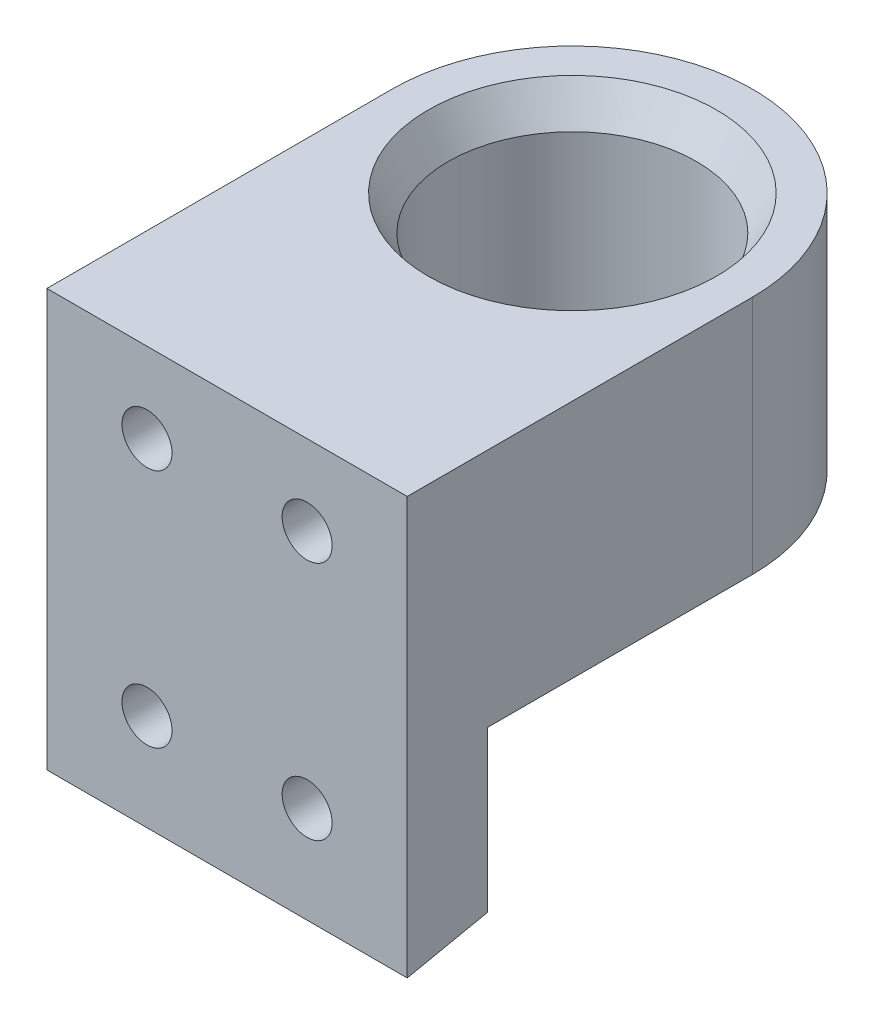
ISO-10303-21;
HEADER;
FILE_DESCRIPTION(('STEP AP214'),'2;1');
FILE_NAME('part.step','',(''),(''),'','','');
FILE_SCHEMA(('AUTOMOTIVE_DESIGN { 1 0 10303 214 1 1 1 1 }'));
ENDSEC;
DATA;
#1=APPLICATION_CONTEXT('core data for automotive mechanical design processes');
#2=APPLICATION_PROTOCOL_DEFINITION('international standard','automotive_design',2000,#1);
#3=PRODUCT_CONTEXT('',#1,'mechanical');
#4=PRODUCT('Part','Part','',(#3));
#5=PRODUCT_RELATED_PRODUCT_CATEGORY('part','',(#4));
#6=PRODUCT_DEFINITION_FORMATION('','',#4);
#7=PRODUCT_DEFINITION_CONTEXT('part definition',#1,'design');
#8=PRODUCT_DEFINITION('design','',#6,#7);
#9=PRODUCT_DEFINITION_SHAPE('','',#8);
#10=(LENGTH_UNIT() NAMED_UNIT(*) SI_UNIT(.MILLI.,.METRE.));
#11=(NAMED_UNIT(*) PLANE_ANGLE_UNIT() SI_UNIT($,.RADIAN.));
#12=(NAMED_UNIT(*) SI_UNIT($,.STERADIAN.) SOLID_ANGLE_UNIT());
#13=UNCERTAINTY_MEASURE_WITH_UNIT(LENGTH_MEASURE(1.E-05),#10,'distance_accuracy_value','');
#14=(GEOMETRIC_REPRESENTATION_CONTEXT(3) GLOBAL_UNCERTAINTY_ASSIGNED_CONTEXT((#13)) GLOBAL_UNIT_ASSIGNED_CONTEXT((#10,
#11,#12)) REPRESENTATION_CONTEXT('',''));
#15=CARTESIAN_POINT('',(0.,0.,0.));
#16=DIRECTION('',(0.,0.,1.));
#17=DIRECTION('',(1.,0.,0.));
#18=AXIS2_PLACEMENT_3D('',#15,#16,#17);
#19=CARTESIAN_POINT('',(0.,0.,0.));
#20=DIRECTION('',(0.,0.,1.));
#21=DIRECTION('',(1.,0.,0.));
#22=AXIS2_PLACEMENT_3D('',#19,#20,#21);
#23=PLANE('',#22);
#24=CARTESIAN_POINT('',(-3.99999999999996,45.949999999998,0.));
#25=DIRECTION('',(0.,0.,1.));
#26=DIRECTION('',(1.,0.,0.));
#27=AXIS2_PLACEMENT_3D('',#24,#25,#26);
#28=CIRCLE('',#27,1.25);
#29=CARTESIAN_POINT('',(-2.74999999999996,45.949999999998,0.));
#30=VERTEX_POINT('',#29);
#31=EDGE_CURVE('E480',#30,#30,#28,.F.);
#32=ORIENTED_EDGE('',*,*,#31,.T.);
#33=EDGE_LOOP('',(#32));
#34=FACE_BOUND('',#33,.T.);
#35=CARTESIAN_POINT('',(4.00000000000005,33.949999999998,0.));
#36=DIRECTION('',(0.,0.,1.));
#37=DIRECTION('',(1.,0.,0.));
#38=AXIS2_PLACEMENT_3D('',#35,#36,#37);
#39=CIRCLE('',#38,1.25);
#40=CARTESIAN_POINT('',(5.25000000000005,33.949999999998,0.));
#41=VERTEX_POINT('',#40);
#42=EDGE_CURVE('E489',#41,#41,#39,.F.);
#43=ORIENTED_EDGE('',*,*,#42,.T.);
#44=EDGE_LOOP('',(#43));
#45=FACE_BOUND('',#44,.T.);
#46=CARTESIAN_POINT('',(-3.99999999999996,33.949999999998,0.));
#47=DIRECTION('',(0.,0.,1.));
#48=DIRECTION('',(1.,0.,0.));
#49=AXIS2_PLACEMENT_3D('',#46,#47,#48);
#50=CIRCLE('',#49,1.25);
#51=CARTESIAN_POINT('',(-2.74999999999996,33.949999999998,0.));
#52=VERTEX_POINT('',#51);
#53=EDGE_CURVE('E492',#52,#52,#50,.F.);
#54=ORIENTED_EDGE('',*,*,#53,.T.);
#55=EDGE_LOOP('',(#54));
#56=FACE_BOUND('',#55,.T.);
#57=CARTESIAN_POINT('',(4.00000000000005,45.949999999998,0.));
#58=DIRECTION('',(0.,0.,1.));
#59=DIRECTION('',(1.,0.,0.));
#60=AXIS2_PLACEMENT_3D('',#57,#58,#59);
#61=CIRCLE('',#60,1.25);
#62=CARTESIAN_POINT('',(5.25000000000005,45.949999999998,0.));
#63=VERTEX_POINT('',#62);
#64=EDGE_CURVE('E484',#63,#63,#61,.F.);
#65=ORIENTED_EDGE('',*,*,#64,.T.);
#66=EDGE_LOOP('',(#65));
#67=FACE_BOUND('',#66,.T.);
#68=DIRECTION('',(1.,0.,0.));
#69=VECTOR('',#68,1.);
#70=CARTESIAN_POINT('',(-6.49999999999996,49.949999999998,0.));
#71=LINE('',#70,#69);
#72=CARTESIAN_POINT('',(-8.99999999999995,49.949999999998,0.));
#73=VERTEX_POINT('',#72);
#74=CARTESIAN_POINT('',(9.00000000000005,49.949999999998,0.));
#75=VERTEX_POINT('',#74);
#76=EDGE_CURVE('E461',#73,#75,#71,.T.);
#77=ORIENTED_EDGE('',*,*,#76,.F.);
#78=DIRECTION('',(0.,-1.,0.));
#79=VECTOR('',#78,1.);
#80=CARTESIAN_POINT('',(-8.99999999999995,37.949999999998,0.));
#81=LINE('',#80,#79);
#82=CARTESIAN_POINT('',(-8.99999999999996,29.1166661729509,0.));
#83=VERTEX_POINT('',#82);
#84=EDGE_CURVE('E472',#73,#83,#81,.T.);
#85=ORIENTED_EDGE('',*,*,#84,.T.);
#86=DIRECTION('',(-1.,0.,0.));
#87=VECTOR('',#86,1.);
#88=CARTESIAN_POINT('',(36.2946756253056,29.1166661729509,0.));
#89=LINE('',#88,#87);
#90=CARTESIAN_POINT('',(9.00000000000005,29.1166661729509,0.));
#91=VERTEX_POINT('',#90);
#92=EDGE_CURVE('E476',#91,#83,#89,.T.);
#93=ORIENTED_EDGE('',*,*,#92,.F.);
#94=DIRECTION('',(0.,1.,0.));
#95=VECTOR('',#94,1.);
#96=CARTESIAN_POINT('',(9.00000000000005,37.949999999998,0.));
#97=LINE('',#96,#95);
#98=EDGE_CURVE('E475',#91,#75,#97,.T.);
#99=ORIENTED_EDGE('',*,*,#98,.T.);
#100=EDGE_LOOP('',(#77,#85,#93,#99));
#101=FACE_BOUND('',#100,.T.);
#102=ADVANCED_FACE('F401',(#34,#45,#56,#67,#101),#23,.T.);
#103=CARTESIAN_POINT('',(-1.39594096278655E-13,-23.9468118973006,-17.2500071094743));
#104=DIRECTION('',(0.,1.,0.));
#105=DIRECTION('',(0.,0.,1.));
#106=AXIS2_PLACEMENT_3D('',#103,#104,#105);
#107=CYLINDRICAL_SURFACE('',#106,6.2);
#108=CARTESIAN_POINT('',(-1.39594096278655E-13,48.2179491924292,-17.2500071094743));
#109=DIRECTION('',(0.,1.,0.));
#110=DIRECTION('',(0.,0.,1.));
#111=AXIS2_PLACEMENT_3D('',#108,#109,#110);
#112=CIRCLE('',#111,6.2);
#113=CARTESIAN_POINT('',(-1.39594096278655E-13,48.2179491924292,-11.0500071094743));
#114=VERTEX_POINT('',#113);
#115=EDGE_CURVE('E505',#114,#114,#112,.T.);
#116=ORIENTED_EDGE('',*,*,#115,.T.);
#117=EDGE_LOOP('',(#116));
#118=FACE_BOUND('',#117,.T.);
#119=CARTESIAN_POINT('',(-1.39594096278655E-13,39.6820508075669,-17.2500071094743));
#120=DIRECTION('',(0.,1.,0.));
#121=DIRECTION('',(0.,0.,1.));
#122=AXIS2_PLACEMENT_3D('',#119,#120,#121);
#123=CIRCLE('',#122,6.2);
#124=CARTESIAN_POINT('',(-1.39594096278655E-13,39.6820508075669,-11.0500071094743));
#125=VERTEX_POINT('',#124);
#126=EDGE_CURVE('E502',#125,#125,#123,.F.);
#127=ORIENTED_EDGE('',*,*,#126,.T.);
#128=EDGE_LOOP('',(#127));
#129=FACE_BOUND('',#128,.T.);
#130=ADVANCED_FACE('F518',(#118,#129),#107,.F.);
#131=CARTESIAN_POINT('',(-8.99999999999995,37.949999999998,-30.000014218949));
#132=DIRECTION('',(0.,1.,0.));
#133=DIRECTION('',(0.,0.,1.));
#134=AXIS2_PLACEMENT_3D('',#131,#132,#133);
#135=PLANE('',#134);
#136=CARTESIAN_POINT('',(-1.39594096278655E-13,37.949999999998,-17.2500071094743));
#137=DIRECTION('',(0.,1.,0.));
#138=DIRECTION('',(0.,0.,1.));
#139=AXIS2_PLACEMENT_3D('',#136,#137,#138);
#140=CIRCLE('',#139,7.2);
#141=CARTESIAN_POINT('',(-1.39594096278655E-13,37.949999999998,-10.0500071094743));
#142=VERTEX_POINT('',#141);
#143=EDGE_CURVE('E13',#142,#142,#140,.T.);
#144=ORIENTED_EDGE('',*,*,#143,.T.);
#145=EDGE_LOOP('',(#144));
#146=FACE_BOUND('',#145,.T.);
#147=DIRECTION('',(0.,0.,1.));
#148=VECTOR('',#147,1.);
#149=CARTESIAN_POINT('',(9.00000000000005,37.949999999998,-30.000014218949));
#150=LINE('',#149,#148);
#151=CARTESIAN_POINT('',(9.00000000000006,37.949999999998,-17.2500071094689));
#152=VERTEX_POINT('',#151);
#153=CARTESIAN_POINT('',(9.00000000000005,37.949999999998,-4.));
#154=VERTEX_POINT('',#153);
#155=EDGE_CURVE('E536',#152,#154,#150,.T.);
#156=ORIENTED_EDGE('',*,*,#155,.T.);
#157=DIRECTION('',(-1.,0.,0.));
#158=VECTOR('',#157,1.);
#159=CARTESIAN_POINT('',(36.2946756253056,37.949999999998,-4.));
#160=LINE('',#159,#158);
#161=CARTESIAN_POINT('',(-8.99999999999996,37.949999999998,-4.));
#162=VERTEX_POINT('',#161);
#163=EDGE_CURVE('E538',#154,#162,#160,.T.);
#164=ORIENTED_EDGE('',*,*,#163,.T.);
#165=DIRECTION('',(0.,0.,1.));
#166=VECTOR('',#165,1.);
#167=CARTESIAN_POINT('',(-8.99999999999995,37.949999999998,-30.000014218949));
#168=LINE('',#167,#166);
#169=CARTESIAN_POINT('',(-8.99999999999995,37.949999999998,-17.2500071094689));
#170=VERTEX_POINT('',#169);
#171=EDGE_CURVE('E468',#170,#162,#168,.T.);
#172=ORIENTED_EDGE('',*,*,#171,.F.);
#173=CARTESIAN_POINT('',(0.,37.949999999998,-17.2500071094689));
#174=DIRECTION('',(0.,1.,0.));
#175=DIRECTION('',(0.,0.,1.));
#176=AXIS2_PLACEMENT_3D('',#173,#174,#175);
#177=CIRCLE('',#176,9.);
#178=EDGE_CURVE('E496',#170,#152,#177,.F.);
#179=ORIENTED_EDGE('',*,*,#178,.T.);
#180=EDGE_LOOP('',(#156,#164,#172,#179));
#181=FACE_BOUND('',#180,.T.);
#182=ADVANCED_FACE('F521',(#146,#181),#135,.F.);
#183=CARTESIAN_POINT('',(0.,-23.9468118973006,-17.2500071094689));
#184=DIRECTION('',(0.,1.,0.));
#185=DIRECTION('',(0.,0.,1.));
#186=AXIS2_PLACEMENT_3D('',#183,#184,#185);
#187=CYLINDRICAL_SURFACE('',#186,9.);
#188=DIRECTION('',(0.,-1.,0.));
#189=VECTOR('',#188,1.);
#190=CARTESIAN_POINT('',(-8.99999999999995,37.949999999998,-17.2500071094689));
#191=LINE('',#190,#189);
#192=CARTESIAN_POINT('',(-8.99999999999994,49.949999999998,-17.2500071094689));
#193=VERTEX_POINT('',#192);
#194=EDGE_CURVE('E542',#193,#170,#191,.T.);
#195=ORIENTED_EDGE('',*,*,#194,.F.);
#196=CARTESIAN_POINT('',(0.,49.949999999998,-17.2500071094689));
#197=DIRECTION('',(0.,-1.,0.));
#198=DIRECTION('',(0.,0.,-1.));
#199=AXIS2_PLACEMENT_3D('',#196,#197,#198);
#200=CIRCLE('',#199,9.);
#201=CARTESIAN_POINT('',(9.00000000000006,49.949999999998,-17.2500071094689));
#202=VERTEX_POINT('',#201);
#203=EDGE_CURVE('E463',#193,#202,#200,.T.);
#204=ORIENTED_EDGE('',*,*,#203,.T.);
#205=DIRECTION('',(0.,1.,0.));
#206=VECTOR('',#205,1.);
#207=CARTESIAN_POINT('',(9.00000000000006,-23.9468118973006,-17.2500071094689));
#208=LINE('',#207,#206);
#209=EDGE_CURVE('E548',#152,#202,#208,.T.);
#210=ORIENTED_EDGE('',*,*,#209,.F.);
#211=ORIENTED_EDGE('',*,*,#178,.F.);
#212=EDGE_LOOP('',(#195,#204,#210,#211));
#213=FACE_BOUND('',#212,.T.);
#214=ADVANCED_FACE('F531',(#213),#187,.T.);
#215=CARTESIAN_POINT('',(-6.49999999999996,49.949999999998,-27.6132347424758));
#216=DIRECTION('',(0.,1.,0.));
#217=DIRECTION('',(0.,0.,1.));
#218=AXIS2_PLACEMENT_3D('',#215,#216,#217);
#219=PLANE('',#218);
#220=CARTESIAN_POINT('',(-1.39594096278655E-13,49.949999999998,-17.2500071094743));
#221=DIRECTION('',(0.,1.,0.));
#222=DIRECTION('',(0.,0.,1.));
#223=AXIS2_PLACEMENT_3D('',#220,#221,#222);
#224=CIRCLE('',#223,7.19999999999999);
#225=CARTESIAN_POINT('',(-1.39594096278655E-13,49.949999999998,-10.0500071094743));
#226=VERTEX_POINT('',#225);
#227=EDGE_CURVE('E410',#226,#226,#224,.F.);
#228=ORIENTED_EDGE('',*,*,#227,.T.);
#229=EDGE_LOOP('',(#228));
#230=FACE_BOUND('',#229,.T.);
#231=DIRECTION('',(0.,0.,1.));
#232=VECTOR('',#231,1.);
#233=CARTESIAN_POINT('',(-8.99999999999995,49.949999999998,-30.000014218949));
#234=LINE('',#233,#232);
#235=EDGE_CURVE('E457',#193,#73,#234,.T.);
#236=ORIENTED_EDGE('',*,*,#235,.T.);
#237=ORIENTED_EDGE('',*,*,#76,.T.);
#238=DIRECTION('',(0.,0.,1.));
#239=VECTOR('',#238,1.);
#240=CARTESIAN_POINT('',(9.00000000000005,49.949999999998,-30.000014218949));
#241=LINE('',#240,#239);
#242=EDGE_CURVE('E467',#202,#75,#241,.T.);
#243=ORIENTED_EDGE('',*,*,#242,.F.);
#244=ORIENTED_EDGE('',*,*,#203,.F.);
#245=EDGE_LOOP('',(#236,#237,#243,#244));
#246=FACE_BOUND('',#245,.T.);
#247=ADVANCED_FACE('F459',(#230,#246),#219,.T.);
#248=CARTESIAN_POINT('',(36.2946756253056,37.949999999998,-4.));
#249=DIRECTION('',(0.,0.,-1.));
#250=DIRECTION('',(0.,1.,0.));
#251=AXIS2_PLACEMENT_3D('',#248,#249,#250);
#252=PLANE('',#251);
#253=CARTESIAN_POINT('',(-3.99999999999996,33.949999999998,-4.));
#254=DIRECTION('',(0.,0.,-1.));
#255=DIRECTION('',(0.,1.,0.));
#256=AXIS2_PLACEMENT_3D('',#253,#254,#255);
#257=CIRCLE('',#256,1.25);
#258=CARTESIAN_POINT('',(-3.99999999999996,35.199999999998,-4.));
#259=VERTEX_POINT('',#258);
#260=EDGE_CURVE('E558',#259,#259,#257,.T.);
#261=ORIENTED_EDGE('',*,*,#260,.F.);
#262=EDGE_LOOP('',(#261));
#263=FACE_BOUND('',#262,.T.);
#264=CARTESIAN_POINT('',(4.00000000000005,33.949999999998,-4.));
#265=DIRECTION('',(0.,0.,-1.));
#266=DIRECTION('',(0.,1.,0.));
#267=AXIS2_PLACEMENT_3D('',#264,#265,#266);
#268=CIRCLE('',#267,1.25);
#269=CARTESIAN_POINT('',(4.00000000000005,35.199999999998,-4.));
#270=VERTEX_POINT('',#269);
#271=EDGE_CURVE('E506',#270,#270,#268,.T.);
#272=ORIENTED_EDGE('',*,*,#271,.F.);
#273=EDGE_LOOP('',(#272));
#274=FACE_BOUND('',#273,.T.);
#275=DIRECTION('',(0.,1.,0.));
#276=VECTOR('',#275,1.);
#277=CARTESIAN_POINT('',(9.00000000000005,37.949999999998,-4.));
#278=LINE('',#277,#276);
#279=CARTESIAN_POINT('',(9.00000000000005,29.949999999998,-4.));
#280=VERTEX_POINT('',#279);
#281=EDGE_CURVE('E499',#280,#154,#278,.T.);
#282=ORIENTED_EDGE('',*,*,#281,.F.);
#283=DIRECTION('',(-1.,0.,0.));
#284=VECTOR('',#283,1.);
#285=CARTESIAN_POINT('',(36.2946756253056,29.949999999998,-4.));
#286=LINE('',#285,#284);
#287=CARTESIAN_POINT('',(-8.99999999999996,29.949999999998,-4.));
#288=VERTEX_POINT('',#287);
#289=EDGE_CURVE('E422',#280,#288,#286,.T.);
#290=ORIENTED_EDGE('',*,*,#289,.T.);
#291=DIRECTION('',(0.,-1.,0.));
#292=VECTOR('',#291,1.);
#293=CARTESIAN_POINT('',(-8.99999999999996,37.949999999998,-4.));
#294=LINE('',#293,#292);
#295=EDGE_CURVE('E417',#162,#288,#294,.T.);
#296=ORIENTED_EDGE('',*,*,#295,.F.);
#297=ORIENTED_EDGE('',*,*,#163,.F.);
#298=EDGE_LOOP('',(#282,#290,#296,#297));
#299=FACE_BOUND('',#298,.T.);
#300=ADVANCED_FACE('F575',(#263,#274,#299),#252,.T.);
#301=CARTESIAN_POINT('',(-3.99999999999996,33.949999999998,10.));
#302=DIRECTION('',(0.,0.,-1.));
#303=DIRECTION('',(0.,1.,0.));
#304=AXIS2_PLACEMENT_3D('',#301,#302,#303);
#305=CYLINDRICAL_SURFACE('',#304,1.25);
#306=ORIENTED_EDGE('',*,*,#260,.T.);
#307=EDGE_LOOP('',(#306));
#308=FACE_BOUND('',#307,.T.);
#309=ORIENTED_EDGE('',*,*,#53,.F.);
#310=EDGE_LOOP('',(#309));
#311=FACE_BOUND('',#310,.T.);
#312=ADVANCED_FACE('F580',(#308,#311),#305,.F.);
#313=CARTESIAN_POINT('',(4.00000000000005,33.949999999998,10.));
#314=DIRECTION('',(0.,0.,-1.));
#315=DIRECTION('',(0.,1.,0.));
#316=AXIS2_PLACEMENT_3D('',#313,#314,#315);
#317=CYLINDRICAL_SURFACE('',#316,1.25);
#318=ORIENTED_EDGE('',*,*,#271,.T.);
#319=EDGE_LOOP('',(#318));
#320=FACE_BOUND('',#319,.T.);
#321=ORIENTED_EDGE('',*,*,#42,.F.);
#322=EDGE_LOOP('',(#321));
#323=FACE_BOUND('',#322,.T.);
#324=ADVANCED_FACE('F596',(#320,#323),#317,.F.);
#325=CARTESIAN_POINT('',(-8.99999999999995,37.949999999998,-30.000014218949));
#326=DIRECTION('',(1.,0.,0.));
#327=DIRECTION('',(0.,1.,0.));
#328=AXIS2_PLACEMENT_3D('',#325,#326,#327);
#329=PLANE('',#328);
#330=ORIENTED_EDGE('',*,*,#84,.F.);
#331=ORIENTED_EDGE('',*,*,#235,.F.);
#332=ORIENTED_EDGE('',*,*,#194,.T.);
#333=ORIENTED_EDGE('',*,*,#171,.T.);
#334=ORIENTED_EDGE('',*,*,#295,.T.);
#335=DIRECTION('',(0.,-0.203954369919658,0.978980395611003));
#336=VECTOR('',#335,1.);
#337=CARTESIAN_POINT('',(-8.99999999999996,29.949999999998,-4.));
#338=LINE('',#337,#336);
#339=EDGE_CURVE('E479',#288,#83,#338,.T.);
#340=ORIENTED_EDGE('',*,*,#339,.T.);
#341=EDGE_LOOP('',(#330,#331,#332,#333,#334,#340));
#342=FACE_BOUND('',#341,.T.);
#343=ADVANCED_FACE('F478',(#342),#329,.F.);
#344=CARTESIAN_POINT('',(9.00000000000005,37.949999999998,-30.000014218949));
#345=DIRECTION('',(-1.,0.,0.));
#346=DIRECTION('',(0.,0.,1.));
#347=AXIS2_PLACEMENT_3D('',#344,#345,#346);
#348=PLANE('',#347);
#349=ORIENTED_EDGE('',*,*,#98,.F.);
#350=DIRECTION('',(0.,0.203954369919658,-0.978980395611003));
#351=VECTOR('',#350,1.);
#352=CARTESIAN_POINT('',(9.00000000000005,29.949999999998,-4.));
#353=LINE('',#352,#351);
#354=EDGE_CURVE('E497',#91,#280,#353,.T.);
#355=ORIENTED_EDGE('',*,*,#354,.T.);
#356=ORIENTED_EDGE('',*,*,#281,.T.);
#357=ORIENTED_EDGE('',*,*,#155,.F.);
#358=ORIENTED_EDGE('',*,*,#209,.T.);
#359=ORIENTED_EDGE('',*,*,#242,.T.);
#360=EDGE_LOOP('',(#349,#355,#356,#357,#358,#359));
#361=FACE_BOUND('',#360,.T.);
#362=ADVANCED_FACE('F568',(#361),#348,.F.);
#363=CARTESIAN_POINT('',(36.2946756253056,29.949999999998,-4.));
#364=DIRECTION('',(0.,-0.978980395611003,-0.203954369919658));
#365=DIRECTION('',(0.,0.203954369919658,-0.978980395611003));
#366=AXIS2_PLACEMENT_3D('',#363,#364,#365);
#367=PLANE('',#366);
#368=ORIENTED_EDGE('',*,*,#354,.F.);
#369=ORIENTED_EDGE('',*,*,#92,.T.);
#370=ORIENTED_EDGE('',*,*,#339,.F.);
#371=ORIENTED_EDGE('',*,*,#289,.F.);
#372=EDGE_LOOP('',(#368,#369,#370,#371));
#373=FACE_BOUND('',#372,.T.);
#374=ADVANCED_FACE('F567',(#373),#367,.T.);
#375=CARTESIAN_POINT('',(4.00000000000005,45.949999999998,-9.99999999999999));
#376=DIRECTION('',(0.,0.,1.));
#377=DIRECTION('',(1.,0.,0.));
#378=AXIS2_PLACEMENT_3D('',#375,#376,#377);
#379=PLANE('',#378);
#380=CARTESIAN_POINT('',(4.00000000000005,45.949999999998,-9.99999999999999));
#381=DIRECTION('',(0.,0.,1.));
#382=DIRECTION('',(1.,0.,0.));
#383=AXIS2_PLACEMENT_3D('',#380,#381,#382);
#384=CIRCLE('',#383,1.25);
#385=CARTESIAN_POINT('',(5.25000000000005,45.949999999998,-9.99999999999999));
#386=VERTEX_POINT('',#385);
#387=EDGE_CURVE('E501',#386,#386,#384,.T.);
#388=ORIENTED_EDGE('',*,*,#387,.T.);
#389=EDGE_LOOP('',(#388));
#390=FACE_BOUND('',#389,.T.);
#391=ADVANCED_FACE('F587',(#390),#379,.T.);
#392=CARTESIAN_POINT('',(4.00000000000005,45.949999999998,-9.99999999999999));
#393=DIRECTION('',(0.,0.,1.));
#394=DIRECTION('',(1.,0.,0.));
#395=AXIS2_PLACEMENT_3D('',#392,#393,#394);
#396=CYLINDRICAL_SURFACE('',#395,1.25);
#397=ORIENTED_EDGE('',*,*,#387,.F.);
#398=EDGE_LOOP('',(#397));
#399=FACE_BOUND('',#398,.T.);
#400=ORIENTED_EDGE('',*,*,#64,.F.);
#401=EDGE_LOOP('',(#400));
#402=FACE_BOUND('',#401,.T.);
#403=ADVANCED_FACE('F585',(#399,#402),#396,.F.);
#404=CARTESIAN_POINT('',(-3.99999999999996,45.949999999998,-9.99999999999999));
#405=DIRECTION('',(0.,0.,1.));
#406=DIRECTION('',(1.,0.,0.));
#407=AXIS2_PLACEMENT_3D('',#404,#405,#406);
#408=PLANE('',#407);
#409=CARTESIAN_POINT('',(-3.99999999999996,45.949999999998,-9.99999999999999));
#410=DIRECTION('',(0.,0.,1.));
#411=DIRECTION('',(1.,0.,0.));
#412=AXIS2_PLACEMENT_3D('',#409,#410,#411);
#413=CIRCLE('',#412,1.25);
#414=CARTESIAN_POINT('',(-2.74999999999996,45.949999999998,-9.99999999999999));
#415=VERTEX_POINT('',#414);
#416=EDGE_CURVE('E555',#415,#415,#413,.T.);
#417=ORIENTED_EDGE('',*,*,#416,.T.);
#418=EDGE_LOOP('',(#417));
#419=FACE_BOUND('',#418,.T.);
#420=ADVANCED_FACE('F582',(#419),#408,.T.);
#421=CARTESIAN_POINT('',(-3.99999999999996,45.949999999998,-9.99999999999999));
#422=DIRECTION('',(0.,0.,1.));
#423=DIRECTION('',(1.,0.,0.));
#424=AXIS2_PLACEMENT_3D('',#421,#422,#423);
#425=CYLINDRICAL_SURFACE('',#424,1.25);
#426=ORIENTED_EDGE('',*,*,#416,.F.);
#427=EDGE_LOOP('',(#426));
#428=FACE_BOUND('',#427,.T.);
#429=ORIENTED_EDGE('',*,*,#31,.F.);
#430=EDGE_LOOP('',(#429));
#431=FACE_BOUND('',#430,.T.);
#432=ADVANCED_FACE('F515',(#428,#431),#425,.F.);
#433=CARTESIAN_POINT('',(-1.39594096278655E-13,48.2179491924292,-17.2500071094743));
#434=DIRECTION('',(0.,1.,0.));
#435=DIRECTION('',(0.,0.,1.));
#436=AXIS2_PLACEMENT_3D('',#433,#434,#435);
#437=CONICAL_SURFACE('',#436,6.2,0.523598775598301);
#438=ORIENTED_EDGE('',*,*,#227,.F.);
#439=EDGE_LOOP('',(#438));
#440=FACE_BOUND('',#439,.T.);
#441=ORIENTED_EDGE('',*,*,#115,.F.);
#442=EDGE_LOOP('',(#441));
#443=FACE_BOUND('',#442,.T.);
#444=ADVANCED_FACE('F512',(#440,#443),#437,.F.);
#445=CARTESIAN_POINT('',(-1.39594096278655E-13,37.949999999998,-17.2500071094743));
#446=DIRECTION('',(0.,-1.,0.));
#447=DIRECTION('',(0.,0.,-1.));
#448=AXIS2_PLACEMENT_3D('',#445,#446,#447);
#449=CONICAL_SURFACE('',#448,7.2,0.523598775598301);
#450=ORIENTED_EDGE('',*,*,#126,.F.);
#451=EDGE_LOOP('',(#450));
#452=FACE_BOUND('',#451,.T.);
#453=ORIENTED_EDGE('',*,*,#143,.F.);
#454=EDGE_LOOP('',(#453));
#455=FACE_BOUND('',#454,.T.);
#456=ADVANCED_FACE('F404',(#452,#455),#449,.F.);
#457=CLOSED_SHELL('',(#102,#130,#182,#214,#247,#300,#312,#324,#343,#362,#374,#391,#403,#420,
#432,#444,#456));
#458=MANIFOLD_SOLID_BREP('B2',#457);
#459=ADVANCED_BREP_SHAPE_REPRESENTATION('',(#18,#458),#14);
#460=SHAPE_DEFINITION_REPRESENTATION(#9,#459);
ENDSEC;
END-ISO-10303-21;
